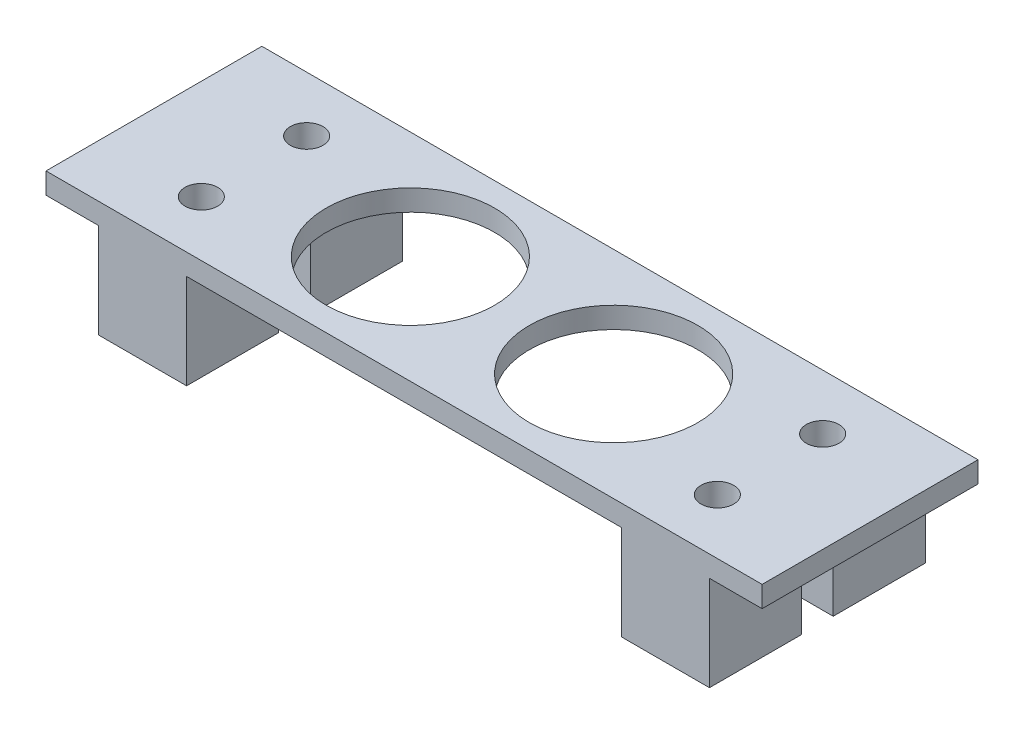
ISO-10303-21;
HEADER;
FILE_DESCRIPTION(('STEP AP214'),'2;1');
FILE_NAME('part.step','',(''),(''),'','','');
FILE_SCHEMA(('AUTOMOTIVE_DESIGN { 1 0 10303 214 1 1 1 1 }'));
ENDSEC;
DATA;
#1=APPLICATION_CONTEXT('core data for automotive mechanical design processes');
#2=APPLICATION_PROTOCOL_DEFINITION('international standard','automotive_design',2000,#1);
#3=PRODUCT_CONTEXT('',#1,'mechanical');
#4=PRODUCT('Part','Part','',(#3));
#5=PRODUCT_RELATED_PRODUCT_CATEGORY('part','',(#4));
#6=PRODUCT_DEFINITION_FORMATION('','',#4);
#7=PRODUCT_DEFINITION_CONTEXT('part definition',#1,'design');
#8=PRODUCT_DEFINITION('design','',#6,#7);
#9=PRODUCT_DEFINITION_SHAPE('','',#8);
#10=(LENGTH_UNIT() NAMED_UNIT(*) SI_UNIT(.MILLI.,.METRE.));
#11=(NAMED_UNIT(*) PLANE_ANGLE_UNIT() SI_UNIT($,.RADIAN.));
#12=(NAMED_UNIT(*) SI_UNIT($,.STERADIAN.) SOLID_ANGLE_UNIT());
#13=UNCERTAINTY_MEASURE_WITH_UNIT(LENGTH_MEASURE(1.E-05),#10,'distance_accuracy_value','');
#14=(GEOMETRIC_REPRESENTATION_CONTEXT(3) GLOBAL_UNCERTAINTY_ASSIGNED_CONTEXT((#13)) GLOBAL_UNIT_ASSIGNED_CONTEXT((#10,
#11,#12)) REPRESENTATION_CONTEXT('',''));
#15=CARTESIAN_POINT('',(0.,0.,0.));
#16=DIRECTION('',(0.,0.,1.));
#17=DIRECTION('',(1.,0.,0.));
#18=AXIS2_PLACEMENT_3D('',#15,#16,#17);
#19=CARTESIAN_POINT('',(29.,2.,0.));
#20=DIRECTION('',(1.,0.,0.));
#21=DIRECTION('',(0.,0.,-1.));
#22=AXIS2_PLACEMENT_3D('',#19,#20,#21);
#23=PLANE('',#22);
#24=DIRECTION('',(0.,-1.,0.));
#25=VECTOR('',#24,1.);
#26=CARTESIAN_POINT('',(29.,2.,-10.25));
#27=LINE('',#26,#25);
#28=CARTESIAN_POINT('',(29.,0.,-10.25));
#29=VERTEX_POINT('',#28);
#30=CARTESIAN_POINT('',(29.,-9.,-10.25));
#31=VERTEX_POINT('',#30);
#32=EDGE_CURVE('E47',#29,#31,#27,.T.);
#33=ORIENTED_EDGE('',*,*,#32,.F.);
#34=DIRECTION('',(0.,0.,1.));
#35=VECTOR('',#34,1.);
#36=CARTESIAN_POINT('',(29.,0.,10.25));
#37=LINE('',#36,#35);
#38=CARTESIAN_POINT('',(29.,0.,-1.5));
#39=VERTEX_POINT('',#38);
#40=EDGE_CURVE('E55',#29,#39,#37,.T.);
#41=ORIENTED_EDGE('',*,*,#40,.T.);
#42=DIRECTION('',(0.,1.,0.));
#43=VECTOR('',#42,1.);
#44=CARTESIAN_POINT('',(29.,-9.,-1.5));
#45=LINE('',#44,#43);
#46=CARTESIAN_POINT('',(29.,-9.,-1.5));
#47=VERTEX_POINT('',#46);
#48=EDGE_CURVE('E260',#47,#39,#45,.T.);
#49=ORIENTED_EDGE('',*,*,#48,.F.);
#50=DIRECTION('',(0.,0.,1.));
#51=VECTOR('',#50,1.);
#52=CARTESIAN_POINT('',(29.,-9.,0.));
#53=LINE('',#52,#51);
#54=EDGE_CURVE('E253',#31,#47,#53,.T.);
#55=ORIENTED_EDGE('',*,*,#54,.F.);
#56=EDGE_LOOP('',(#33,#41,#49,#55));
#57=FACE_BOUND('',#56,.T.);
#58=ADVANCED_FACE('F43',(#57),#23,.T.);
#59=DIRECTION('',(0.,1.,0.));
#60=VECTOR('',#59,1.);
#61=CARTESIAN_POINT('',(29.,-9.,1.5));
#62=LINE('',#61,#60);
#63=CARTESIAN_POINT('',(29.,-9.,1.5));
#64=VERTEX_POINT('',#63);
#65=CARTESIAN_POINT('',(29.,0.,1.5));
#66=VERTEX_POINT('',#65);
#67=EDGE_CURVE('E307',#64,#66,#62,.T.);
#68=ORIENTED_EDGE('',*,*,#67,.T.);
#69=CARTESIAN_POINT('',(29.,0.,10.25));
#70=VERTEX_POINT('',#69);
#71=EDGE_CURVE('E11',#66,#70,#37,.T.);
#72=ORIENTED_EDGE('',*,*,#71,.T.);
#73=DIRECTION('',(0.,-1.,0.));
#74=VECTOR('',#73,1.);
#75=CARTESIAN_POINT('',(29.,2.,10.25));
#76=LINE('',#75,#74);
#77=CARTESIAN_POINT('',(29.,-9.,10.25));
#78=VERTEX_POINT('',#77);
#79=EDGE_CURVE('E204',#70,#78,#76,.T.);
#80=ORIENTED_EDGE('',*,*,#79,.T.);
#81=DIRECTION('',(0.,0.,1.));
#82=VECTOR('',#81,1.);
#83=CARTESIAN_POINT('',(29.,-9.,0.));
#84=LINE('',#83,#82);
#85=EDGE_CURVE('E291',#64,#78,#84,.T.);
#86=ORIENTED_EDGE('',*,*,#85,.F.);
#87=EDGE_LOOP('',(#68,#72,#80,#86));
#88=FACE_BOUND('',#87,.T.);
#89=ADVANCED_FACE('F497',(#88),#23,.T.);
#90=CARTESIAN_POINT('',(-29.,2.,0.));
#91=DIRECTION('',(1.,0.,0.));
#92=DIRECTION('',(0.,0.,-1.));
#93=AXIS2_PLACEMENT_3D('',#90,#91,#92);
#94=PLANE('',#93);
#95=DIRECTION('',(0.,-1.,0.));
#96=VECTOR('',#95,1.);
#97=CARTESIAN_POINT('',(-29.,2.,10.25));
#98=LINE('',#97,#96);
#99=CARTESIAN_POINT('',(-29.,0.,10.25));
#100=VERTEX_POINT('',#99);
#101=CARTESIAN_POINT('',(-29.,-9.,10.25));
#102=VERTEX_POINT('',#101);
#103=EDGE_CURVE('E436',#100,#102,#98,.T.);
#104=ORIENTED_EDGE('',*,*,#103,.F.);
#105=DIRECTION('',(0.,0.,-1.));
#106=VECTOR('',#105,1.);
#107=CARTESIAN_POINT('',(-29.,0.,10.25));
#108=LINE('',#107,#106);
#109=CARTESIAN_POINT('',(-29.,0.,1.5));
#110=VERTEX_POINT('',#109);
#111=EDGE_CURVE('E216',#100,#110,#108,.T.);
#112=ORIENTED_EDGE('',*,*,#111,.T.);
#113=DIRECTION('',(0.,1.,0.));
#114=VECTOR('',#113,1.);
#115=CARTESIAN_POINT('',(-29.,-9.,1.5));
#116=LINE('',#115,#114);
#117=CARTESIAN_POINT('',(-29.,-9.,1.5));
#118=VERTEX_POINT('',#117);
#119=EDGE_CURVE('E385',#118,#110,#116,.T.);
#120=ORIENTED_EDGE('',*,*,#119,.F.);
#121=DIRECTION('',(0.,0.,-1.));
#122=VECTOR('',#121,1.);
#123=CARTESIAN_POINT('',(-29.,-9.,0.));
#124=LINE('',#123,#122);
#125=EDGE_CURVE('E356',#102,#118,#124,.T.);
#126=ORIENTED_EDGE('',*,*,#125,.F.);
#127=EDGE_LOOP('',(#104,#112,#120,#126));
#128=FACE_BOUND('',#127,.T.);
#129=ADVANCED_FACE('F502',(#128),#94,.F.);
#130=CARTESIAN_POINT('',(0.,0.,0.));
#131=DIRECTION('',(0.,1.,0.));
#132=DIRECTION('',(0.,0.,1.));
#133=AXIS2_PLACEMENT_3D('',#130,#131,#132);
#134=PLANE('',#133);
#135=CARTESIAN_POINT('',(-9.65,0.,0.));
#136=DIRECTION('',(0.,1.,0.));
#137=DIRECTION('',(0.,0.,1.));
#138=AXIS2_PLACEMENT_3D('',#135,#136,#137);
#139=CIRCLE('',#138,8.);
#140=CARTESIAN_POINT('',(-9.65,0.,8.));
#141=VERTEX_POINT('',#140);
#142=EDGE_CURVE('E424',#141,#141,#139,.T.);
#143=ORIENTED_EDGE('',*,*,#142,.T.);
#144=EDGE_LOOP('',(#143));
#145=FACE_BOUND('',#144,.T.);
#146=CARTESIAN_POINT('',(9.65,0.,0.));
#147=DIRECTION('',(0.,1.,0.));
#148=DIRECTION('',(0.,0.,1.));
#149=AXIS2_PLACEMENT_3D('',#146,#147,#148);
#150=CIRCLE('',#149,8.);
#151=CARTESIAN_POINT('',(9.65,0.,8.));
#152=VERTEX_POINT('',#151);
#153=EDGE_CURVE('E389',#152,#152,#150,.T.);
#154=ORIENTED_EDGE('',*,*,#153,.T.);
#155=EDGE_LOOP('',(#154));
#156=FACE_BOUND('',#155,.T.);
#157=DIRECTION('',(0.,0.,-1.));
#158=VECTOR('',#157,1.);
#159=CARTESIAN_POINT('',(20.65,0.,0.));
#160=LINE('',#159,#158);
#161=CARTESIAN_POINT('',(20.65,0.,-1.5));
#162=VERTEX_POINT('',#161);
#163=CARTESIAN_POINT('',(20.65,0.,-10.25));
#164=VERTEX_POINT('',#163);
#165=EDGE_CURVE('E246',#162,#164,#160,.T.);
#166=ORIENTED_EDGE('',*,*,#165,.F.);
#167=DIRECTION('',(1.,0.,0.));
#168=VECTOR('',#167,1.);
#169=CARTESIAN_POINT('',(0.,0.,-1.5));
#170=LINE('',#169,#168);
#171=EDGE_CURVE('E237',#162,#39,#170,.T.);
#172=ORIENTED_EDGE('',*,*,#171,.T.);
#173=ORIENTED_EDGE('',*,*,#40,.F.);
#174=DIRECTION('',(-1.,0.,0.));
#175=VECTOR('',#174,1.);
#176=CARTESIAN_POINT('',(29.,0.,-10.25));
#177=LINE('',#176,#175);
#178=CARTESIAN_POINT('',(34.,0.,-10.25));
#179=VERTEX_POINT('',#178);
#180=EDGE_CURVE('E195',#179,#29,#177,.T.);
#181=ORIENTED_EDGE('',*,*,#180,.F.);
#182=DIRECTION('',(0.,0.,-1.));
#183=VECTOR('',#182,1.);
#184=CARTESIAN_POINT('',(34.,0.,10.25));
#185=LINE('',#184,#183);
#186=CARTESIAN_POINT('',(34.,0.,10.25));
#187=VERTEX_POINT('',#186);
#188=EDGE_CURVE('E188',#187,#179,#185,.T.);
#189=ORIENTED_EDGE('',*,*,#188,.F.);
#190=DIRECTION('',(1.,0.,0.));
#191=VECTOR('',#190,1.);
#192=CARTESIAN_POINT('',(29.,0.,10.25));
#193=LINE('',#192,#191);
#194=EDGE_CURVE('E62',#70,#187,#193,.T.);
#195=ORIENTED_EDGE('',*,*,#194,.F.);
#196=ORIENTED_EDGE('',*,*,#71,.F.);
#197=DIRECTION('',(1.,0.,0.));
#198=VECTOR('',#197,1.);
#199=CARTESIAN_POINT('',(0.,0.,1.5));
#200=LINE('',#199,#198);
#201=CARTESIAN_POINT('',(20.65,0.,1.5));
#202=VERTEX_POINT('',#201);
#203=EDGE_CURVE('E284',#202,#66,#200,.T.);
#204=ORIENTED_EDGE('',*,*,#203,.F.);
#205=DIRECTION('',(0.,0.,-1.));
#206=VECTOR('',#205,1.);
#207=CARTESIAN_POINT('',(20.65,0.,0.));
#208=LINE('',#207,#206);
#209=CARTESIAN_POINT('',(20.65,0.,10.25));
#210=VERTEX_POINT('',#209);
#211=EDGE_CURVE('E278',#210,#202,#208,.T.);
#212=ORIENTED_EDGE('',*,*,#211,.F.);
#213=DIRECTION('',(1.,0.,0.));
#214=VECTOR('',#213,1.);
#215=CARTESIAN_POINT('',(0.,0.,10.25));
#216=LINE('',#215,#214);
#217=CARTESIAN_POINT('',(-20.65,0.,10.25));
#218=VERTEX_POINT('',#217);
#219=EDGE_CURVE('E395',#218,#210,#216,.T.);
#220=ORIENTED_EDGE('',*,*,#219,.F.);
#221=DIRECTION('',(0.,0.,-1.));
#222=VECTOR('',#221,1.);
#223=CARTESIAN_POINT('',(-20.65,0.,0.));
#224=LINE('',#223,#222);
#225=CARTESIAN_POINT('',(-20.65,0.,1.5));
#226=VERTEX_POINT('',#225);
#227=EDGE_CURVE('E357',#218,#226,#224,.T.);
#228=ORIENTED_EDGE('',*,*,#227,.T.);
#229=DIRECTION('',(1.,0.,0.));
#230=VECTOR('',#229,1.);
#231=CARTESIAN_POINT('',(0.,0.,1.5));
#232=LINE('',#231,#230);
#233=EDGE_CURVE('E351',#110,#226,#232,.T.);
#234=ORIENTED_EDGE('',*,*,#233,.F.);
#235=ORIENTED_EDGE('',*,*,#111,.F.);
#236=DIRECTION('',(1.,0.,0.));
#237=VECTOR('',#236,1.);
#238=CARTESIAN_POINT('',(-29.,0.,10.25));
#239=LINE('',#238,#237);
#240=CARTESIAN_POINT('',(-34.,0.,10.25));
#241=VERTEX_POINT('',#240);
#242=EDGE_CURVE('E225',#241,#100,#239,.T.);
#243=ORIENTED_EDGE('',*,*,#242,.F.);
#244=DIRECTION('',(0.,0.,1.));
#245=VECTOR('',#244,1.);
#246=CARTESIAN_POINT('',(-34.,0.,10.25));
#247=LINE('',#246,#245);
#248=CARTESIAN_POINT('',(-34.,0.,-10.25));
#249=VERTEX_POINT('',#248);
#250=EDGE_CURVE('E221',#249,#241,#247,.T.);
#251=ORIENTED_EDGE('',*,*,#250,.F.);
#252=DIRECTION('',(-1.,0.,0.));
#253=VECTOR('',#252,1.);
#254=CARTESIAN_POINT('',(-29.,0.,-10.25));
#255=LINE('',#254,#253);
#256=CARTESIAN_POINT('',(-29.,0.,-10.25));
#257=VERTEX_POINT('',#256);
#258=EDGE_CURVE('E68',#257,#249,#255,.T.);
#259=ORIENTED_EDGE('',*,*,#258,.F.);
#260=CARTESIAN_POINT('',(-29.,0.,-1.5));
#261=VERTEX_POINT('',#260);
#262=EDGE_CURVE('E53',#261,#257,#108,.T.);
#263=ORIENTED_EDGE('',*,*,#262,.F.);
#264=DIRECTION('',(1.,0.,0.));
#265=VECTOR('',#264,1.);
#266=CARTESIAN_POINT('',(0.,0.,-1.5));
#267=LINE('',#266,#265);
#268=CARTESIAN_POINT('',(-20.65,0.,-1.5));
#269=VERTEX_POINT('',#268);
#270=EDGE_CURVE('E314',#261,#269,#267,.T.);
#271=ORIENTED_EDGE('',*,*,#270,.T.);
#272=DIRECTION('',(0.,0.,-1.));
#273=VECTOR('',#272,1.);
#274=CARTESIAN_POINT('',(-20.65,0.,0.));
#275=LINE('',#274,#273);
#276=CARTESIAN_POINT('',(-20.65,0.,-10.25));
#277=VERTEX_POINT('',#276);
#278=EDGE_CURVE('E320',#269,#277,#275,.T.);
#279=ORIENTED_EDGE('',*,*,#278,.T.);
#280=DIRECTION('',(1.,0.,0.));
#281=VECTOR('',#280,1.);
#282=CARTESIAN_POINT('',(0.,0.,-10.25));
#283=LINE('',#282,#281);
#284=EDGE_CURVE('E428',#277,#164,#283,.T.);
#285=ORIENTED_EDGE('',*,*,#284,.T.);
#286=EDGE_LOOP('',(#166,#172,#173,#181,#189,#195,#196,#204,#212,#220,#228,#234,#235,#243,#251,
#259,#263,#271,#279,#285));
#287=FACE_BOUND('',#286,.T.);
#288=ADVANCED_FACE('F197',(#145,#156,#287),#134,.F.);
#289=CARTESIAN_POINT('',(0.,2.,-10.25));
#290=DIRECTION('',(0.,0.,-1.));
#291=DIRECTION('',(-1.,0.,0.));
#292=AXIS2_PLACEMENT_3D('',#289,#290,#291);
#293=PLANE('',#292);
#294=ORIENTED_EDGE('',*,*,#284,.F.);
#295=DIRECTION('',(0.,1.,0.));
#296=VECTOR('',#295,1.);
#297=CARTESIAN_POINT('',(-20.65,-9.,-10.25));
#298=LINE('',#297,#296);
#299=CARTESIAN_POINT('',(-20.65,-9.,-10.25));
#300=VERTEX_POINT('',#299);
#301=EDGE_CURVE('E344',#300,#277,#298,.T.);
#302=ORIENTED_EDGE('',*,*,#301,.F.);
#303=DIRECTION('',(1.,0.,0.));
#304=VECTOR('',#303,1.);
#305=CARTESIAN_POINT('',(0.,-9.,-10.25));
#306=LINE('',#305,#304);
#307=CARTESIAN_POINT('',(-29.,-9.,-10.25));
#308=VERTEX_POINT('',#307);
#309=EDGE_CURVE('E324',#308,#300,#306,.T.);
#310=ORIENTED_EDGE('',*,*,#309,.F.);
#311=DIRECTION('',(0.,-1.,0.));
#312=VECTOR('',#311,1.);
#313=CARTESIAN_POINT('',(-29.,2.,-10.25));
#314=LINE('',#313,#312);
#315=EDGE_CURVE('E438',#257,#308,#314,.T.);
#316=ORIENTED_EDGE('',*,*,#315,.F.);
#317=ORIENTED_EDGE('',*,*,#258,.T.);
#318=DIRECTION('',(0.,1.,0.));
#319=VECTOR('',#318,1.);
#320=CARTESIAN_POINT('',(-34.,0.,-10.25));
#321=LINE('',#320,#319);
#322=CARTESIAN_POINT('',(-34.,2.,-10.25));
#323=VERTEX_POINT('',#322);
#324=EDGE_CURVE('E229',#249,#323,#321,.T.);
#325=ORIENTED_EDGE('',*,*,#324,.T.);
#326=DIRECTION('',(1.,0.,0.));
#327=VECTOR('',#326,1.);
#328=CARTESIAN_POINT('',(0.,2.,-10.25));
#329=LINE('',#328,#327);
#330=CARTESIAN_POINT('',(34.,2.,-10.25));
#331=VERTEX_POINT('',#330);
#332=EDGE_CURVE('E415',#323,#331,#329,.T.);
#333=ORIENTED_EDGE('',*,*,#332,.T.);
#334=DIRECTION('',(0.,1.,0.));
#335=VECTOR('',#334,1.);
#336=CARTESIAN_POINT('',(34.,0.,-10.25));
#337=LINE('',#336,#335);
#338=EDGE_CURVE('E194',#179,#331,#337,.T.);
#339=ORIENTED_EDGE('',*,*,#338,.F.);
#340=ORIENTED_EDGE('',*,*,#180,.T.);
#341=ORIENTED_EDGE('',*,*,#32,.T.);
#342=DIRECTION('',(1.,0.,0.));
#343=VECTOR('',#342,1.);
#344=CARTESIAN_POINT('',(0.,-9.,-10.25));
#345=LINE('',#344,#343);
#346=CARTESIAN_POINT('',(20.65,-9.,-10.25));
#347=VERTEX_POINT('',#346);
#348=EDGE_CURVE('E249',#347,#31,#345,.T.);
#349=ORIENTED_EDGE('',*,*,#348,.F.);
#350=DIRECTION('',(0.,1.,0.));
#351=VECTOR('',#350,1.);
#352=CARTESIAN_POINT('',(20.65,-9.,-10.25));
#353=LINE('',#352,#351);
#354=EDGE_CURVE('E270',#347,#164,#353,.T.);
#355=ORIENTED_EDGE('',*,*,#354,.T.);
#356=EDGE_LOOP('',(#294,#302,#310,#316,#317,#325,#333,#339,#340,#341,#349,#355));
#357=FACE_BOUND('',#356,.T.);
#358=ADVANCED_FACE('F452',(#357),#293,.T.);
#359=DIRECTION('',(0.,1.,0.));
#360=VECTOR('',#359,1.);
#361=CARTESIAN_POINT('',(-29.,-9.,-1.5));
#362=LINE('',#361,#360);
#363=CARTESIAN_POINT('',(-29.,-9.,-1.5));
#364=VERTEX_POINT('',#363);
#365=EDGE_CURVE('E347',#364,#261,#362,.T.);
#366=ORIENTED_EDGE('',*,*,#365,.T.);
#367=ORIENTED_EDGE('',*,*,#262,.T.);
#368=ORIENTED_EDGE('',*,*,#315,.T.);
#369=DIRECTION('',(0.,0.,-1.));
#370=VECTOR('',#369,1.);
#371=CARTESIAN_POINT('',(-29.,-9.,0.));
#372=LINE('',#371,#370);
#373=EDGE_CURVE('E319',#364,#308,#372,.T.);
#374=ORIENTED_EDGE('',*,*,#373,.F.);
#375=EDGE_LOOP('',(#366,#367,#368,#374));
#376=FACE_BOUND('',#375,.T.);
#377=ADVANCED_FACE('F448',(#376),#94,.F.);
#378=CARTESIAN_POINT('',(-9.65,2.,0.));
#379=DIRECTION('',(0.,-1.,0.));
#380=DIRECTION('',(0.,0.,-1.));
#381=AXIS2_PLACEMENT_3D('',#378,#379,#380);
#382=CYLINDRICAL_SURFACE('',#381,8.);
#383=CARTESIAN_POINT('',(-9.65,2.,0.));
#384=DIRECTION('',(0.,1.,0.));
#385=DIRECTION('',(0.,0.,1.));
#386=AXIS2_PLACEMENT_3D('',#383,#384,#385);
#387=CIRCLE('',#386,8.);
#388=CARTESIAN_POINT('',(-9.65,2.,8.));
#389=VERTEX_POINT('',#388);
#390=EDGE_CURVE('E411',#389,#389,#387,.T.);
#391=ORIENTED_EDGE('',*,*,#390,.T.);
#392=EDGE_LOOP('',(#391));
#393=FACE_BOUND('',#392,.T.);
#394=ORIENTED_EDGE('',*,*,#142,.F.);
#395=EDGE_LOOP('',(#394));
#396=FACE_BOUND('',#395,.T.);
#397=ADVANCED_FACE('F507',(#393,#396),#382,.F.);
#398=CARTESIAN_POINT('',(-24.5,2.,-5.));
#399=DIRECTION('',(0.,-1.,0.));
#400=DIRECTION('',(0.,0.,-1.));
#401=AXIS2_PLACEMENT_3D('',#398,#399,#400);
#402=CYLINDRICAL_SURFACE('',#401,1.55);
#403=CARTESIAN_POINT('',(-24.5,2.,-5.));
#404=DIRECTION('',(0.,1.,0.));
#405=DIRECTION('',(0.,0.,1.));
#406=AXIS2_PLACEMENT_3D('',#403,#404,#405);
#407=CIRCLE('',#406,1.55);
#408=CARTESIAN_POINT('',(-24.5,2.,-3.45));
#409=VERTEX_POINT('',#408);
#410=EDGE_CURVE('E407',#409,#409,#407,.T.);
#411=ORIENTED_EDGE('',*,*,#410,.T.);
#412=EDGE_LOOP('',(#411));
#413=FACE_BOUND('',#412,.T.);
#414=CARTESIAN_POINT('',(-24.5,-9.,-5.));
#415=DIRECTION('',(0.,-1.,0.));
#416=DIRECTION('',(0.,0.,-1.));
#417=AXIS2_PLACEMENT_3D('',#414,#415,#416);
#418=CIRCLE('',#417,1.55);
#419=CARTESIAN_POINT('',(-24.5,-9.,-6.55));
#420=VERTEX_POINT('',#419);
#421=EDGE_CURVE('E331',#420,#420,#418,.F.);
#422=ORIENTED_EDGE('',*,*,#421,.F.);
#423=EDGE_LOOP('',(#422));
#424=FACE_BOUND('',#423,.T.);
#425=ADVANCED_FACE('F493',(#413,#424),#402,.F.);
#426=CARTESIAN_POINT('',(-24.5,2.,5.));
#427=DIRECTION('',(0.,-1.,0.));
#428=DIRECTION('',(0.,0.,-1.));
#429=AXIS2_PLACEMENT_3D('',#426,#427,#428);
#430=CYLINDRICAL_SURFACE('',#429,1.55);
#431=CARTESIAN_POINT('',(-24.5,2.,5.));
#432=DIRECTION('',(0.,1.,0.));
#433=DIRECTION('',(0.,0.,1.));
#434=AXIS2_PLACEMENT_3D('',#431,#432,#433);
#435=CIRCLE('',#434,1.55);
#436=CARTESIAN_POINT('',(-24.5,2.,6.55));
#437=VERTEX_POINT('',#436);
#438=EDGE_CURVE('E403',#437,#437,#435,.T.);
#439=ORIENTED_EDGE('',*,*,#438,.T.);
#440=EDGE_LOOP('',(#439));
#441=FACE_BOUND('',#440,.T.);
#442=CARTESIAN_POINT('',(-24.5,-9.,5.));
#443=DIRECTION('',(0.,-1.,0.));
#444=DIRECTION('',(0.,0.,-1.));
#445=AXIS2_PLACEMENT_3D('',#442,#443,#444);
#446=CIRCLE('',#445,1.55);
#447=CARTESIAN_POINT('',(-24.5,-9.,3.45));
#448=VERTEX_POINT('',#447);
#449=EDGE_CURVE('E352',#448,#448,#446,.F.);
#450=ORIENTED_EDGE('',*,*,#449,.F.);
#451=EDGE_LOOP('',(#450));
#452=FACE_BOUND('',#451,.T.);
#453=ADVANCED_FACE('F485',(#441,#452),#430,.F.);
#454=CARTESIAN_POINT('',(24.5,2.,-5.00000000000001));
#455=DIRECTION('',(0.,-1.,0.));
#456=DIRECTION('',(0.,0.,-1.));
#457=AXIS2_PLACEMENT_3D('',#454,#455,#456);
#458=CYLINDRICAL_SURFACE('',#457,1.55);
#459=CARTESIAN_POINT('',(24.5,2.,-5.00000000000001));
#460=DIRECTION('',(0.,1.,0.));
#461=DIRECTION('',(0.,0.,1.));
#462=AXIS2_PLACEMENT_3D('',#459,#460,#461);
#463=CIRCLE('',#462,1.55);
#464=CARTESIAN_POINT('',(24.5,2.,-3.45000000000001));
#465=VERTEX_POINT('',#464);
#466=EDGE_CURVE('E399',#465,#465,#463,.T.);
#467=ORIENTED_EDGE('',*,*,#466,.T.);
#468=EDGE_LOOP('',(#467));
#469=FACE_BOUND('',#468,.T.);
#470=CARTESIAN_POINT('',(24.5,-9.,-5.00000000000001));
#471=DIRECTION('',(0.,-1.,0.));
#472=DIRECTION('',(0.,0.,-1.));
#473=AXIS2_PLACEMENT_3D('',#470,#471,#472);
#474=CIRCLE('',#473,1.55);
#475=CARTESIAN_POINT('',(24.5,-9.,-6.55000000000001));
#476=VERTEX_POINT('',#475);
#477=EDGE_CURVE('E256',#476,#476,#474,.F.);
#478=ORIENTED_EDGE('',*,*,#477,.F.);
#479=EDGE_LOOP('',(#478));
#480=FACE_BOUND('',#479,.T.);
#481=ADVANCED_FACE('F482',(#469,#480),#458,.F.);
#482=CARTESIAN_POINT('',(24.5,2.,5.00000000000001));
#483=DIRECTION('',(0.,-1.,0.));
#484=DIRECTION('',(0.,0.,-1.));
#485=AXIS2_PLACEMENT_3D('',#482,#483,#484);
#486=CYLINDRICAL_SURFACE('',#485,1.55);
#487=CARTESIAN_POINT('',(24.5,2.,5.00000000000001));
#488=DIRECTION('',(0.,1.,0.));
#489=DIRECTION('',(0.,0.,1.));
#490=AXIS2_PLACEMENT_3D('',#487,#488,#489);
#491=CIRCLE('',#490,1.55);
#492=CARTESIAN_POINT('',(24.5,2.,6.55000000000001));
#493=VERTEX_POINT('',#492);
#494=EDGE_CURVE('E394',#493,#493,#491,.T.);
#495=ORIENTED_EDGE('',*,*,#494,.T.);
#496=EDGE_LOOP('',(#495));
#497=FACE_BOUND('',#496,.T.);
#498=CARTESIAN_POINT('',(24.5,-9.,5.00000000000001));
#499=DIRECTION('',(0.,-1.,0.));
#500=DIRECTION('',(0.,0.,-1.));
#501=AXIS2_PLACEMENT_3D('',#498,#499,#500);
#502=CIRCLE('',#501,1.55);
#503=CARTESIAN_POINT('',(24.5,-9.,3.45000000000001));
#504=VERTEX_POINT('',#503);
#505=EDGE_CURVE('E279',#504,#504,#502,.F.);
#506=ORIENTED_EDGE('',*,*,#505,.F.);
#507=EDGE_LOOP('',(#506));
#508=FACE_BOUND('',#507,.T.);
#509=ADVANCED_FACE('F484',(#497,#508),#486,.F.);
#510=CARTESIAN_POINT('',(9.65,2.,0.));
#511=DIRECTION('',(0.,-1.,0.));
#512=DIRECTION('',(0.,0.,-1.));
#513=AXIS2_PLACEMENT_3D('',#510,#511,#512);
#514=CYLINDRICAL_SURFACE('',#513,8.);
#515=CARTESIAN_POINT('',(9.65,2.,0.));
#516=DIRECTION('',(0.,1.,0.));
#517=DIRECTION('',(0.,0.,1.));
#518=AXIS2_PLACEMENT_3D('',#515,#516,#517);
#519=CIRCLE('',#518,8.);
#520=CARTESIAN_POINT('',(9.65,2.,8.));
#521=VERTEX_POINT('',#520);
#522=EDGE_CURVE('E390',#521,#521,#519,.T.);
#523=ORIENTED_EDGE('',*,*,#522,.T.);
#524=EDGE_LOOP('',(#523));
#525=FACE_BOUND('',#524,.T.);
#526=ORIENTED_EDGE('',*,*,#153,.F.);
#527=EDGE_LOOP('',(#526));
#528=FACE_BOUND('',#527,.T.);
#529=ADVANCED_FACE('F45',(#525,#528),#514,.F.);
#530=CARTESIAN_POINT('',(0.,2.,10.25));
#531=DIRECTION('',(0.,0.,-1.));
#532=DIRECTION('',(-1.,0.,0.));
#533=AXIS2_PLACEMENT_3D('',#530,#531,#532);
#534=PLANE('',#533);
#535=DIRECTION('',(1.,0.,0.));
#536=VECTOR('',#535,1.);
#537=CARTESIAN_POINT('',(0.,2.,10.25));
#538=LINE('',#537,#536);
#539=CARTESIAN_POINT('',(-34.,2.,10.25));
#540=VERTEX_POINT('',#539);
#541=CARTESIAN_POINT('',(34.,2.,10.25));
#542=VERTEX_POINT('',#541);
#543=EDGE_CURVE('E418',#540,#542,#538,.T.);
#544=ORIENTED_EDGE('',*,*,#543,.F.);
#545=DIRECTION('',(0.,1.,0.));
#546=VECTOR('',#545,1.);
#547=CARTESIAN_POINT('',(-34.,0.,10.25));
#548=LINE('',#547,#546);
#549=EDGE_CURVE('E233',#241,#540,#548,.T.);
#550=ORIENTED_EDGE('',*,*,#549,.F.);
#551=ORIENTED_EDGE('',*,*,#242,.T.);
#552=ORIENTED_EDGE('',*,*,#103,.T.);
#553=DIRECTION('',(-1.,0.,0.));
#554=VECTOR('',#553,1.);
#555=CARTESIAN_POINT('',(0.,-9.,10.25));
#556=LINE('',#555,#554);
#557=CARTESIAN_POINT('',(-20.65,-9.,10.25));
#558=VERTEX_POINT('',#557);
#559=EDGE_CURVE('E368',#558,#102,#556,.T.);
#560=ORIENTED_EDGE('',*,*,#559,.F.);
#561=DIRECTION('',(0.,1.,0.));
#562=VECTOR('',#561,1.);
#563=CARTESIAN_POINT('',(-20.65,-9.,10.25));
#564=LINE('',#563,#562);
#565=EDGE_CURVE('E372',#558,#218,#564,.T.);
#566=ORIENTED_EDGE('',*,*,#565,.T.);
#567=ORIENTED_EDGE('',*,*,#219,.T.);
#568=DIRECTION('',(0.,1.,0.));
#569=VECTOR('',#568,1.);
#570=CARTESIAN_POINT('',(20.65,-9.,10.25));
#571=LINE('',#570,#569);
#572=CARTESIAN_POINT('',(20.65,-9.,10.25));
#573=VERTEX_POINT('',#572);
#574=EDGE_CURVE('E298',#573,#210,#571,.T.);
#575=ORIENTED_EDGE('',*,*,#574,.F.);
#576=DIRECTION('',(-1.,0.,0.));
#577=VECTOR('',#576,1.);
#578=CARTESIAN_POINT('',(0.,-9.,10.25));
#579=LINE('',#578,#577);
#580=EDGE_CURVE('E295',#78,#573,#579,.T.);
#581=ORIENTED_EDGE('',*,*,#580,.F.);
#582=ORIENTED_EDGE('',*,*,#79,.F.);
#583=ORIENTED_EDGE('',*,*,#194,.T.);
#584=DIRECTION('',(0.,1.,0.));
#585=VECTOR('',#584,1.);
#586=CARTESIAN_POINT('',(34.,0.,10.25));
#587=LINE('',#586,#585);
#588=EDGE_CURVE('E185',#187,#542,#587,.T.);
#589=ORIENTED_EDGE('',*,*,#588,.T.);
#590=EDGE_LOOP('',(#544,#550,#551,#552,#560,#566,#567,#575,#581,#582,#583,#589));
#591=FACE_BOUND('',#590,.T.);
#592=ADVANCED_FACE('F202',(#591),#534,.F.);
#593=CARTESIAN_POINT('',(0.,2.,0.));
#594=DIRECTION('',(0.,1.,0.));
#595=DIRECTION('',(0.,0.,1.));
#596=AXIS2_PLACEMENT_3D('',#593,#594,#595);
#597=PLANE('',#596);
#598=ORIENTED_EDGE('',*,*,#522,.F.);
#599=EDGE_LOOP('',(#598));
#600=FACE_BOUND('',#599,.T.);
#601=ORIENTED_EDGE('',*,*,#494,.F.);
#602=EDGE_LOOP('',(#601));
#603=FACE_BOUND('',#602,.T.);
#604=ORIENTED_EDGE('',*,*,#466,.F.);
#605=EDGE_LOOP('',(#604));
#606=FACE_BOUND('',#605,.T.);
#607=ORIENTED_EDGE('',*,*,#438,.F.);
#608=EDGE_LOOP('',(#607));
#609=FACE_BOUND('',#608,.T.);
#610=ORIENTED_EDGE('',*,*,#410,.F.);
#611=EDGE_LOOP('',(#610));
#612=FACE_BOUND('',#611,.T.);
#613=ORIENTED_EDGE('',*,*,#390,.F.);
#614=EDGE_LOOP('',(#613));
#615=FACE_BOUND('',#614,.T.);
#616=ORIENTED_EDGE('',*,*,#543,.T.);
#617=DIRECTION('',(0.,0.,-1.));
#618=VECTOR('',#617,1.);
#619=CARTESIAN_POINT('',(34.,2.,10.25));
#620=LINE('',#619,#618);
#621=EDGE_CURVE('E191',#542,#331,#620,.T.);
#622=ORIENTED_EDGE('',*,*,#621,.T.);
#623=ORIENTED_EDGE('',*,*,#332,.F.);
#624=DIRECTION('',(0.,0.,1.));
#625=VECTOR('',#624,1.);
#626=CARTESIAN_POINT('',(-34.,2.,10.25));
#627=LINE('',#626,#625);
#628=EDGE_CURVE('E214',#323,#540,#627,.T.);
#629=ORIENTED_EDGE('',*,*,#628,.T.);
#630=EDGE_LOOP('',(#616,#622,#623,#629));
#631=FACE_BOUND('',#630,.T.);
#632=ADVANCED_FACE('F545',(#600,#603,#606,#609,#612,#615,#631),#597,.T.);
#633=CARTESIAN_POINT('',(0.,-9.,1.5));
#634=DIRECTION('',(0.,0.,1.));
#635=DIRECTION('',(1.,0.,0.));
#636=AXIS2_PLACEMENT_3D('',#633,#634,#635);
#637=PLANE('',#636);
#638=ORIENTED_EDGE('',*,*,#233,.T.);
#639=DIRECTION('',(0.,1.,0.));
#640=VECTOR('',#639,1.);
#641=CARTESIAN_POINT('',(-20.65,-9.,1.5));
#642=LINE('',#641,#640);
#643=CARTESIAN_POINT('',(-20.65,-9.,1.5));
#644=VERTEX_POINT('',#643);
#645=EDGE_CURVE('E381',#644,#226,#642,.T.);
#646=ORIENTED_EDGE('',*,*,#645,.F.);
#647=DIRECTION('',(1.,0.,0.));
#648=VECTOR('',#647,1.);
#649=CARTESIAN_POINT('',(0.,-9.,1.5));
#650=LINE('',#649,#648);
#651=EDGE_CURVE('E361',#118,#644,#650,.T.);
#652=ORIENTED_EDGE('',*,*,#651,.F.);
#653=ORIENTED_EDGE('',*,*,#119,.T.);
#654=EDGE_LOOP('',(#638,#646,#652,#653));
#655=FACE_BOUND('',#654,.T.);
#656=ADVANCED_FACE('F541',(#655),#637,.F.);
#657=CARTESIAN_POINT('',(-20.65,-9.,0.));
#658=DIRECTION('',(1.,0.,0.));
#659=DIRECTION('',(0.,0.,-1.));
#660=AXIS2_PLACEMENT_3D('',#657,#658,#659);
#661=PLANE('',#660);
#662=ORIENTED_EDGE('',*,*,#227,.F.);
#663=ORIENTED_EDGE('',*,*,#565,.F.);
#664=DIRECTION('',(0.,0.,-1.));
#665=VECTOR('',#664,1.);
#666=CARTESIAN_POINT('',(-20.65,-9.,0.));
#667=LINE('',#666,#665);
#668=EDGE_CURVE('E364',#558,#644,#667,.T.);
#669=ORIENTED_EDGE('',*,*,#668,.T.);
#670=ORIENTED_EDGE('',*,*,#645,.T.);
#671=EDGE_LOOP('',(#662,#663,#669,#670));
#672=FACE_BOUND('',#671,.T.);
#673=ADVANCED_FACE('F537',(#672),#661,.T.);
#674=CARTESIAN_POINT('',(0.,-9.,0.));
#675=DIRECTION('',(0.,-1.,0.));
#676=DIRECTION('',(0.,0.,-1.));
#677=AXIS2_PLACEMENT_3D('',#674,#675,#676);
#678=PLANE('',#677);
#679=ORIENTED_EDGE('',*,*,#449,.T.);
#680=EDGE_LOOP('',(#679));
#681=FACE_BOUND('',#680,.T.);
#682=ORIENTED_EDGE('',*,*,#125,.T.);
#683=ORIENTED_EDGE('',*,*,#651,.T.);
#684=ORIENTED_EDGE('',*,*,#668,.F.);
#685=ORIENTED_EDGE('',*,*,#559,.T.);
#686=EDGE_LOOP('',(#682,#683,#684,#685));
#687=FACE_BOUND('',#686,.T.);
#688=ADVANCED_FACE('F534',(#681,#687),#678,.T.);
#689=CARTESIAN_POINT('',(0.,-9.,-1.5));
#690=DIRECTION('',(0.,0.,1.));
#691=DIRECTION('',(1.,0.,0.));
#692=AXIS2_PLACEMENT_3D('',#689,#690,#691);
#693=PLANE('',#692);
#694=ORIENTED_EDGE('',*,*,#270,.F.);
#695=ORIENTED_EDGE('',*,*,#365,.F.);
#696=DIRECTION('',(1.,0.,0.));
#697=VECTOR('',#696,1.);
#698=CARTESIAN_POINT('',(0.,-9.,-1.5));
#699=LINE('',#698,#697);
#700=CARTESIAN_POINT('',(-20.65,-9.,-1.5));
#701=VERTEX_POINT('',#700);
#702=EDGE_CURVE('E315',#364,#701,#699,.T.);
#703=ORIENTED_EDGE('',*,*,#702,.T.);
#704=DIRECTION('',(0.,1.,0.));
#705=VECTOR('',#704,1.);
#706=CARTESIAN_POINT('',(-20.65,-9.,-1.5));
#707=LINE('',#706,#705);
#708=EDGE_CURVE('E335',#701,#269,#707,.T.);
#709=ORIENTED_EDGE('',*,*,#708,.T.);
#710=EDGE_LOOP('',(#694,#695,#703,#709));
#711=FACE_BOUND('',#710,.T.);
#712=ADVANCED_FACE('F460',(#711),#693,.T.);
#713=CARTESIAN_POINT('',(-20.65,-9.,0.));
#714=DIRECTION('',(1.,0.,0.));
#715=DIRECTION('',(0.,0.,-1.));
#716=AXIS2_PLACEMENT_3D('',#713,#714,#715);
#717=PLANE('',#716);
#718=ORIENTED_EDGE('',*,*,#278,.F.);
#719=ORIENTED_EDGE('',*,*,#708,.F.);
#720=DIRECTION('',(0.,0.,-1.));
#721=VECTOR('',#720,1.);
#722=CARTESIAN_POINT('',(-20.65,-9.,0.));
#723=LINE('',#722,#721);
#724=EDGE_CURVE('E327',#701,#300,#723,.T.);
#725=ORIENTED_EDGE('',*,*,#724,.T.);
#726=ORIENTED_EDGE('',*,*,#301,.T.);
#727=EDGE_LOOP('',(#718,#719,#725,#726));
#728=FACE_BOUND('',#727,.T.);
#729=ADVANCED_FACE('F520',(#728),#717,.T.);
#730=CARTESIAN_POINT('',(0.,-9.,0.));
#731=DIRECTION('',(0.,-1.,0.));
#732=DIRECTION('',(0.,0.,-1.));
#733=AXIS2_PLACEMENT_3D('',#730,#731,#732);
#734=PLANE('',#733);
#735=ORIENTED_EDGE('',*,*,#702,.F.);
#736=ORIENTED_EDGE('',*,*,#373,.T.);
#737=ORIENTED_EDGE('',*,*,#309,.T.);
#738=ORIENTED_EDGE('',*,*,#724,.F.);
#739=EDGE_LOOP('',(#735,#736,#737,#738));
#740=FACE_BOUND('',#739,.T.);
#741=ORIENTED_EDGE('',*,*,#421,.T.);
#742=EDGE_LOOP('',(#741));
#743=FACE_BOUND('',#742,.T.);
#744=ADVANCED_FACE('F457',(#740,#743),#734,.T.);
#745=CARTESIAN_POINT('',(20.65,-9.,0.));
#746=DIRECTION('',(1.,0.,0.));
#747=DIRECTION('',(0.,0.,-1.));
#748=AXIS2_PLACEMENT_3D('',#745,#746,#747);
#749=PLANE('',#748);
#750=ORIENTED_EDGE('',*,*,#211,.T.);
#751=DIRECTION('',(0.,1.,0.));
#752=VECTOR('',#751,1.);
#753=CARTESIAN_POINT('',(20.65,-9.,1.5));
#754=LINE('',#753,#752);
#755=CARTESIAN_POINT('',(20.65,-9.,1.5));
#756=VERTEX_POINT('',#755);
#757=EDGE_CURVE('E311',#756,#202,#754,.T.);
#758=ORIENTED_EDGE('',*,*,#757,.F.);
#759=DIRECTION('',(0.,0.,-1.));
#760=VECTOR('',#759,1.);
#761=CARTESIAN_POINT('',(20.65,-9.,0.));
#762=LINE('',#761,#760);
#763=EDGE_CURVE('E283',#573,#756,#762,.T.);
#764=ORIENTED_EDGE('',*,*,#763,.F.);
#765=ORIENTED_EDGE('',*,*,#574,.T.);
#766=EDGE_LOOP('',(#750,#758,#764,#765));
#767=FACE_BOUND('',#766,.T.);
#768=ADVANCED_FACE('F519',(#767),#749,.F.);
#769=CARTESIAN_POINT('',(0.,-9.,1.5));
#770=DIRECTION('',(0.,0.,1.));
#771=DIRECTION('',(1.,0.,0.));
#772=AXIS2_PLACEMENT_3D('',#769,#770,#771);
#773=PLANE('',#772);
#774=ORIENTED_EDGE('',*,*,#203,.T.);
#775=ORIENTED_EDGE('',*,*,#67,.F.);
#776=DIRECTION('',(1.,0.,0.));
#777=VECTOR('',#776,1.);
#778=CARTESIAN_POINT('',(0.,-9.,1.5));
#779=LINE('',#778,#777);
#780=EDGE_CURVE('E288',#756,#64,#779,.T.);
#781=ORIENTED_EDGE('',*,*,#780,.F.);
#782=ORIENTED_EDGE('',*,*,#757,.T.);
#783=EDGE_LOOP('',(#774,#775,#781,#782));
#784=FACE_BOUND('',#783,.T.);
#785=ADVANCED_FACE('F526',(#784),#773,.F.);
#786=CARTESIAN_POINT('',(0.,-9.,0.));
#787=DIRECTION('',(0.,-1.,0.));
#788=DIRECTION('',(0.,0.,-1.));
#789=AXIS2_PLACEMENT_3D('',#786,#787,#788);
#790=PLANE('',#789);
#791=ORIENTED_EDGE('',*,*,#505,.T.);
#792=EDGE_LOOP('',(#791));
#793=FACE_BOUND('',#792,.T.);
#794=ORIENTED_EDGE('',*,*,#763,.T.);
#795=ORIENTED_EDGE('',*,*,#780,.T.);
#796=ORIENTED_EDGE('',*,*,#85,.T.);
#797=ORIENTED_EDGE('',*,*,#580,.T.);
#798=EDGE_LOOP('',(#794,#795,#796,#797));
#799=FACE_BOUND('',#798,.T.);
#800=ADVANCED_FACE('F578',(#793,#799),#790,.T.);
#801=CARTESIAN_POINT('',(0.,-9.,-1.5));
#802=DIRECTION('',(0.,0.,1.));
#803=DIRECTION('',(1.,0.,0.));
#804=AXIS2_PLACEMENT_3D('',#801,#802,#803);
#805=PLANE('',#804);
#806=ORIENTED_EDGE('',*,*,#171,.F.);
#807=DIRECTION('',(0.,1.,0.));
#808=VECTOR('',#807,1.);
#809=CARTESIAN_POINT('',(20.65,-9.,-1.5));
#810=LINE('',#809,#808);
#811=CARTESIAN_POINT('',(20.65,-9.,-1.5));
#812=VERTEX_POINT('',#811);
#813=EDGE_CURVE('E274',#812,#162,#810,.T.);
#814=ORIENTED_EDGE('',*,*,#813,.F.);
#815=DIRECTION('',(1.,0.,0.));
#816=VECTOR('',#815,1.);
#817=CARTESIAN_POINT('',(0.,-9.,-1.5));
#818=LINE('',#817,#816);
#819=EDGE_CURVE('E241',#812,#47,#818,.T.);
#820=ORIENTED_EDGE('',*,*,#819,.T.);
#821=ORIENTED_EDGE('',*,*,#48,.T.);
#822=EDGE_LOOP('',(#806,#814,#820,#821));
#823=FACE_BOUND('',#822,.T.);
#824=ADVANCED_FACE('F471',(#823),#805,.T.);
#825=CARTESIAN_POINT('',(20.65,-9.,0.));
#826=DIRECTION('',(1.,0.,0.));
#827=DIRECTION('',(0.,0.,-1.));
#828=AXIS2_PLACEMENT_3D('',#825,#826,#827);
#829=PLANE('',#828);
#830=ORIENTED_EDGE('',*,*,#165,.T.);
#831=ORIENTED_EDGE('',*,*,#354,.F.);
#832=DIRECTION('',(0.,0.,-1.));
#833=VECTOR('',#832,1.);
#834=CARTESIAN_POINT('',(20.65,-9.,0.));
#835=LINE('',#834,#833);
#836=EDGE_CURVE('E245',#812,#347,#835,.T.);
#837=ORIENTED_EDGE('',*,*,#836,.F.);
#838=ORIENTED_EDGE('',*,*,#813,.T.);
#839=EDGE_LOOP('',(#830,#831,#837,#838));
#840=FACE_BOUND('',#839,.T.);
#841=ADVANCED_FACE('F466',(#840),#829,.F.);
#842=CARTESIAN_POINT('',(0.,-9.,0.));
#843=DIRECTION('',(0.,-1.,0.));
#844=DIRECTION('',(0.,0.,-1.));
#845=AXIS2_PLACEMENT_3D('',#842,#843,#844);
#846=PLANE('',#845);
#847=ORIENTED_EDGE('',*,*,#819,.F.);
#848=ORIENTED_EDGE('',*,*,#836,.T.);
#849=ORIENTED_EDGE('',*,*,#348,.T.);
#850=ORIENTED_EDGE('',*,*,#54,.T.);
#851=EDGE_LOOP('',(#847,#848,#849,#850));
#852=FACE_BOUND('',#851,.T.);
#853=ORIENTED_EDGE('',*,*,#477,.T.);
#854=EDGE_LOOP('',(#853));
#855=FACE_BOUND('',#854,.T.);
#856=ADVANCED_FACE('F475',(#852,#855),#846,.T.);
#857=CARTESIAN_POINT('',(-34.,0.,10.25));
#858=DIRECTION('',(-1.,0.,0.));
#859=DIRECTION('',(0.,0.,1.));
#860=AXIS2_PLACEMENT_3D('',#857,#858,#859);
#861=PLANE('',#860);
#862=ORIENTED_EDGE('',*,*,#628,.F.);
#863=ORIENTED_EDGE('',*,*,#324,.F.);
#864=ORIENTED_EDGE('',*,*,#250,.T.);
#865=ORIENTED_EDGE('',*,*,#549,.T.);
#866=EDGE_LOOP('',(#862,#863,#864,#865));
#867=FACE_BOUND('',#866,.T.);
#868=ADVANCED_FACE('F478',(#867),#861,.T.);
#869=CARTESIAN_POINT('',(34.,0.,10.25));
#870=DIRECTION('',(1.,0.,0.));
#871=DIRECTION('',(0.,0.,-1.));
#872=AXIS2_PLACEMENT_3D('',#869,#870,#871);
#873=PLANE('',#872);
#874=ORIENTED_EDGE('',*,*,#621,.F.);
#875=ORIENTED_EDGE('',*,*,#588,.F.);
#876=ORIENTED_EDGE('',*,*,#188,.T.);
#877=ORIENTED_EDGE('',*,*,#338,.T.);
#878=EDGE_LOOP('',(#874,#875,#876,#877));
#879=FACE_BOUND('',#878,.T.);
#880=ADVANCED_FACE('F186',(#879),#873,.T.);
#881=CLOSED_SHELL('',(#58,#89,#129,#288,#358,#377,#397,#425,#453,#481,#509,#529,#592,#632,#656,
#673,#688,#712,#729,#744,#768,#785,#800,#824,#841,#856,#868,#880));
#882=MANIFOLD_SOLID_BREP('B2',#881);
#883=ADVANCED_BREP_SHAPE_REPRESENTATION('',(#18,#882),#14);
#884=SHAPE_DEFINITION_REPRESENTATION(#9,#883);
ENDSEC;
END-ISO-10303-21;
